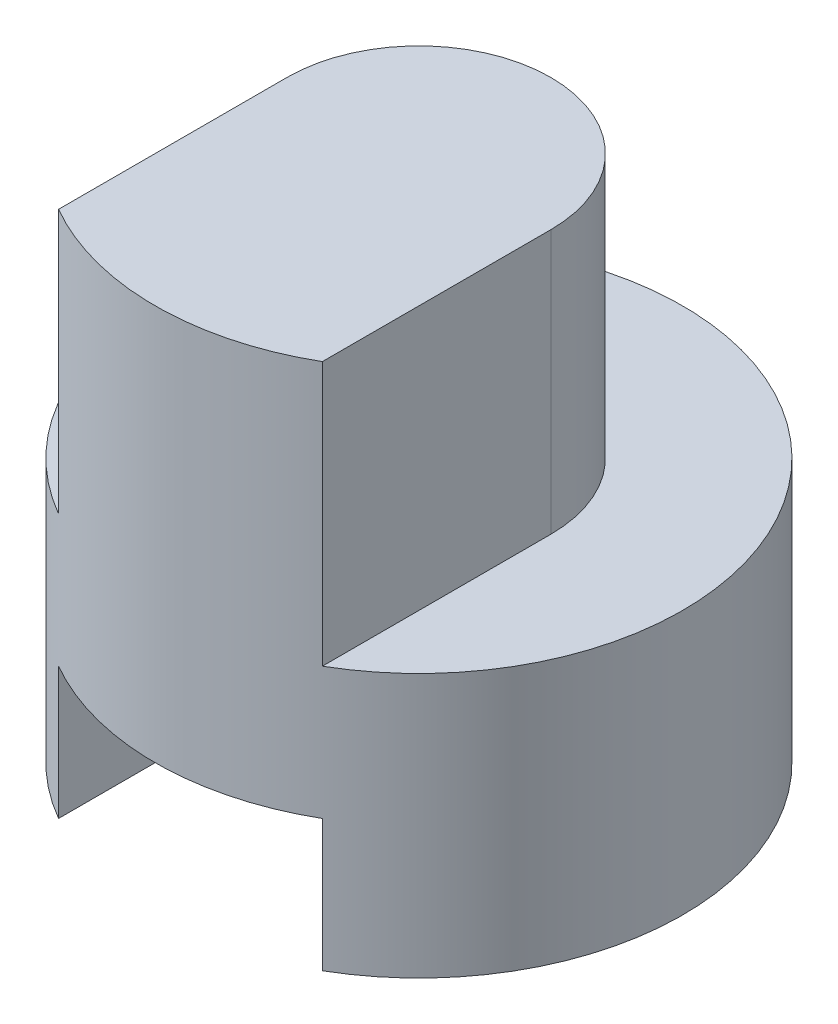
ISO-10303-21;
HEADER;
FILE_DESCRIPTION(('STEP AP214'),'2;1');
FILE_NAME('part.step','',(''),(''),'','','');
FILE_SCHEMA(('AUTOMOTIVE_DESIGN { 1 0 10303 214 1 1 1 1 }'));
ENDSEC;
DATA;
#1=APPLICATION_CONTEXT('core data for automotive mechanical design processes');
#2=APPLICATION_PROTOCOL_DEFINITION('international standard','automotive_design',2000,#1);
#3=PRODUCT_CONTEXT('',#1,'mechanical');
#4=PRODUCT('Part','Part','',(#3));
#5=PRODUCT_RELATED_PRODUCT_CATEGORY('part','',(#4));
#6=PRODUCT_DEFINITION_FORMATION('','',#4);
#7=PRODUCT_DEFINITION_CONTEXT('part definition',#1,'design');
#8=PRODUCT_DEFINITION('design','',#6,#7);
#9=PRODUCT_DEFINITION_SHAPE('','',#8);
#10=(LENGTH_UNIT() NAMED_UNIT(*) SI_UNIT(.MILLI.,.METRE.));
#11=(NAMED_UNIT(*) PLANE_ANGLE_UNIT() SI_UNIT($,.RADIAN.));
#12=(NAMED_UNIT(*) SI_UNIT($,.STERADIAN.) SOLID_ANGLE_UNIT());
#13=UNCERTAINTY_MEASURE_WITH_UNIT(LENGTH_MEASURE(1.E-05),#10,'distance_accuracy_value','');
#14=(GEOMETRIC_REPRESENTATION_CONTEXT(3) GLOBAL_UNCERTAINTY_ASSIGNED_CONTEXT((#13)) GLOBAL_UNIT_ASSIGNED_CONTEXT((#10,
#11,#12)) REPRESENTATION_CONTEXT('',''));
#15=CARTESIAN_POINT('',(0.,0.,0.));
#16=DIRECTION('',(0.,0.,1.));
#17=DIRECTION('',(1.,0.,0.));
#18=AXIS2_PLACEMENT_3D('',#15,#16,#17);
#19=CARTESIAN_POINT('',(0.,2.,0.));
#20=DIRECTION('',(0.,-1.,0.));
#21=DIRECTION('',(0.,0.,-1.));
#22=AXIS2_PLACEMENT_3D('',#19,#20,#21);
#23=CYLINDRICAL_SURFACE('',#22,2.);
#24=CARTESIAN_POINT('',(0.,2.,0.));
#25=DIRECTION('',(0.,1.,0.));
#26=DIRECTION('',(0.,0.,1.));
#27=AXIS2_PLACEMENT_3D('',#24,#25,#26);
#28=CIRCLE('',#27,2.);
#29=CARTESIAN_POINT('',(1.,2.,1.73205080756888));
#30=VERTEX_POINT('',#29);
#31=CARTESIAN_POINT('',(-1.,2.,1.73205080756888));
#32=VERTEX_POINT('',#31);
#33=EDGE_CURVE('E11',#30,#32,#28,.T.);
#34=ORIENTED_EDGE('',*,*,#33,.F.);
#35=DIRECTION('',(0.,-1.,0.));
#36=VECTOR('',#35,1.);
#37=CARTESIAN_POINT('',(1.,4.,1.73205080756888));
#38=LINE('',#37,#36);
#39=CARTESIAN_POINT('',(1.,4.,1.73205080756888));
#40=VERTEX_POINT('',#39);
#41=EDGE_CURVE('E147',#40,#30,#38,.T.);
#42=ORIENTED_EDGE('',*,*,#41,.F.);
#43=CARTESIAN_POINT('',(0.,4.,0.));
#44=DIRECTION('',(0.,1.,0.));
#45=DIRECTION('',(0.,0.,1.));
#46=AXIS2_PLACEMENT_3D('',#43,#44,#45);
#47=CIRCLE('',#46,2.);
#48=CARTESIAN_POINT('',(-1.,4.,1.73205080756888));
#49=VERTEX_POINT('',#48);
#50=EDGE_CURVE('E122',#49,#40,#47,.T.);
#51=ORIENTED_EDGE('',*,*,#50,.F.);
#52=DIRECTION('',(0.,-1.,0.));
#53=VECTOR('',#52,1.);
#54=CARTESIAN_POINT('',(-1.,4.,1.73205080756888));
#55=LINE('',#54,#53);
#56=EDGE_CURVE('E131',#49,#32,#55,.T.);
#57=ORIENTED_EDGE('',*,*,#56,.T.);
#58=EDGE_LOOP('',(#34,#42,#51,#57));
#59=FACE_BOUND('',#58,.T.);
#60=CARTESIAN_POINT('',(0.,1.,0.));
#61=DIRECTION('',(0.,-1.,0.));
#62=DIRECTION('',(0.,0.,1.));
#63=AXIS2_PLACEMENT_3D('',#60,#61,#62);
#64=CIRCLE('',#63,2.);
#65=CARTESIAN_POINT('',(1.,1.,1.73205080756888));
#66=VERTEX_POINT('',#65);
#67=CARTESIAN_POINT('',(-1.,1.,1.73205080756888));
#68=VERTEX_POINT('',#67);
#69=EDGE_CURVE('E103',#66,#68,#64,.T.);
#70=ORIENTED_EDGE('',*,*,#69,.F.);
#71=DIRECTION('',(0.,-1.,0.));
#72=VECTOR('',#71,1.);
#73=CARTESIAN_POINT('',(1.,1.,1.73205080756888));
#74=LINE('',#73,#72);
#75=CARTESIAN_POINT('',(1.,0.,1.73205080756888));
#76=VERTEX_POINT('',#75);
#77=EDGE_CURVE('E136',#66,#76,#74,.T.);
#78=ORIENTED_EDGE('',*,*,#77,.T.);
#79=CARTESIAN_POINT('',(0.,0.,0.));
#80=DIRECTION('',(0.,1.,0.));
#81=DIRECTION('',(0.,0.,1.));
#82=AXIS2_PLACEMENT_3D('',#79,#80,#81);
#83=CIRCLE('',#82,2.);
#84=CARTESIAN_POINT('',(-1.,0.,1.73205080756888));
#85=VERTEX_POINT('',#84);
#86=EDGE_CURVE('E36',#76,#85,#83,.T.);
#87=ORIENTED_EDGE('',*,*,#86,.T.);
#88=DIRECTION('',(0.,-1.,0.));
#89=VECTOR('',#88,1.);
#90=CARTESIAN_POINT('',(-1.,1.,1.73205080756888));
#91=LINE('',#90,#89);
#92=EDGE_CURVE('E47',#68,#85,#91,.T.);
#93=ORIENTED_EDGE('',*,*,#92,.F.);
#94=EDGE_LOOP('',(#70,#78,#87,#93));
#95=FACE_BOUND('',#94,.T.);
#96=ADVANCED_FACE('F33',(#59,#95),#23,.T.);
#97=CARTESIAN_POINT('',(0.,2.,0.));
#98=DIRECTION('',(0.,1.,0.));
#99=DIRECTION('',(0.,0.,1.));
#100=AXIS2_PLACEMENT_3D('',#97,#98,#99);
#101=PLANE('',#100);
#102=DIRECTION('',(0.,0.,1.));
#103=VECTOR('',#102,1.);
#104=CARTESIAN_POINT('',(-1.,2.,1.73205080756888));
#105=LINE('',#104,#103);
#106=CARTESIAN_POINT('',(-1.,2.,0.));
#107=VERTEX_POINT('',#106);
#108=EDGE_CURVE('E54',#107,#32,#105,.T.);
#109=ORIENTED_EDGE('',*,*,#108,.F.);
#110=CARTESIAN_POINT('',(0.,2.,0.));
#111=DIRECTION('',(0.,1.,0.));
#112=DIRECTION('',(0.,0.,-1.));
#113=AXIS2_PLACEMENT_3D('',#110,#111,#112);
#114=CIRCLE('',#113,1.);
#115=CARTESIAN_POINT('',(1.,2.,0.));
#116=VERTEX_POINT('',#115);
#117=EDGE_CURVE('E135',#116,#107,#114,.T.);
#118=ORIENTED_EDGE('',*,*,#117,.F.);
#119=DIRECTION('',(0.,0.,-1.));
#120=VECTOR('',#119,1.);
#121=CARTESIAN_POINT('',(1.,2.,0.));
#122=LINE('',#121,#120);
#123=EDGE_CURVE('E132',#30,#116,#122,.T.);
#124=ORIENTED_EDGE('',*,*,#123,.F.);
#125=ORIENTED_EDGE('',*,*,#33,.T.);
#126=EDGE_LOOP('',(#109,#118,#124,#125));
#127=FACE_BOUND('',#126,.T.);
#128=ADVANCED_FACE('F157',(#127),#101,.T.);
#129=CARTESIAN_POINT('',(0.,0.,0.));
#130=DIRECTION('',(0.,1.,0.));
#131=DIRECTION('',(0.,0.,1.));
#132=AXIS2_PLACEMENT_3D('',#129,#130,#131);
#133=PLANE('',#132);
#134=ORIENTED_EDGE('',*,*,#86,.F.);
#135=DIRECTION('',(0.,0.,1.));
#136=VECTOR('',#135,1.);
#137=CARTESIAN_POINT('',(1.,0.,0.));
#138=LINE('',#137,#136);
#139=CARTESIAN_POINT('',(1.,0.,0.));
#140=VERTEX_POINT('',#139);
#141=EDGE_CURVE('E112',#140,#76,#138,.T.);
#142=ORIENTED_EDGE('',*,*,#141,.F.);
#143=CARTESIAN_POINT('',(0.,0.,0.));
#144=DIRECTION('',(0.,-1.,0.));
#145=DIRECTION('',(0.,0.,-1.));
#146=AXIS2_PLACEMENT_3D('',#143,#144,#145);
#147=CIRCLE('',#146,1.);
#148=CARTESIAN_POINT('',(-1.,0.,0.));
#149=VERTEX_POINT('',#148);
#150=EDGE_CURVE('E242',#149,#140,#147,.T.);
#151=ORIENTED_EDGE('',*,*,#150,.F.);
#152=DIRECTION('',(0.,0.,-1.));
#153=VECTOR('',#152,1.);
#154=CARTESIAN_POINT('',(-1.,0.,1.73205080756888));
#155=LINE('',#154,#153);
#156=EDGE_CURVE('E244',#85,#149,#155,.T.);
#157=ORIENTED_EDGE('',*,*,#156,.F.);
#158=EDGE_LOOP('',(#134,#142,#151,#157));
#159=FACE_BOUND('',#158,.T.);
#160=ADVANCED_FACE('F184',(#159),#133,.F.);
#161=CARTESIAN_POINT('',(1.,4.,0.));
#162=DIRECTION('',(-1.,0.,0.));
#163=DIRECTION('',(0.,0.,1.));
#164=AXIS2_PLACEMENT_3D('',#161,#162,#163);
#165=PLANE('',#164);
#166=ORIENTED_EDGE('',*,*,#123,.T.);
#167=DIRECTION('',(0.,-1.,0.));
#168=VECTOR('',#167,1.);
#169=CARTESIAN_POINT('',(1.,4.,0.));
#170=LINE('',#169,#168);
#171=CARTESIAN_POINT('',(1.,4.,0.));
#172=VERTEX_POINT('',#171);
#173=EDGE_CURVE('E144',#172,#116,#170,.T.);
#174=ORIENTED_EDGE('',*,*,#173,.F.);
#175=DIRECTION('',(0.,0.,-1.));
#176=VECTOR('',#175,1.);
#177=CARTESIAN_POINT('',(1.,4.,0.));
#178=LINE('',#177,#176);
#179=EDGE_CURVE('E125',#40,#172,#178,.T.);
#180=ORIENTED_EDGE('',*,*,#179,.F.);
#181=ORIENTED_EDGE('',*,*,#41,.T.);
#182=EDGE_LOOP('',(#166,#174,#180,#181));
#183=FACE_BOUND('',#182,.T.);
#184=ADVANCED_FACE('F151',(#183),#165,.F.);
#185=CARTESIAN_POINT('',(0.,4.,0.));
#186=DIRECTION('',(0.,-1.,0.));
#187=DIRECTION('',(0.,0.,-1.));
#188=AXIS2_PLACEMENT_3D('',#185,#186,#187);
#189=CYLINDRICAL_SURFACE('',#188,1.);
#190=ORIENTED_EDGE('',*,*,#117,.T.);
#191=DIRECTION('',(0.,-1.,0.));
#192=VECTOR('',#191,1.);
#193=CARTESIAN_POINT('',(-1.,4.,0.));
#194=LINE('',#193,#192);
#195=CARTESIAN_POINT('',(-1.,4.,0.));
#196=VERTEX_POINT('',#195);
#197=EDGE_CURVE('E141',#196,#107,#194,.T.);
#198=ORIENTED_EDGE('',*,*,#197,.F.);
#199=CARTESIAN_POINT('',(0.,4.,0.));
#200=DIRECTION('',(0.,1.,0.));
#201=DIRECTION('',(0.,0.,-1.));
#202=AXIS2_PLACEMENT_3D('',#199,#200,#201);
#203=CIRCLE('',#202,1.);
#204=EDGE_CURVE('E127',#172,#196,#203,.T.);
#205=ORIENTED_EDGE('',*,*,#204,.F.);
#206=ORIENTED_EDGE('',*,*,#173,.T.);
#207=EDGE_LOOP('',(#190,#198,#205,#206));
#208=FACE_BOUND('',#207,.T.);
#209=ADVANCED_FACE('F164',(#208),#189,.T.);
#210=CARTESIAN_POINT('',(-1.,4.,1.73205080756888));
#211=DIRECTION('',(1.,0.,0.));
#212=DIRECTION('',(0.,0.,-1.));
#213=AXIS2_PLACEMENT_3D('',#210,#211,#212);
#214=PLANE('',#213);
#215=ORIENTED_EDGE('',*,*,#108,.T.);
#216=ORIENTED_EDGE('',*,*,#56,.F.);
#217=DIRECTION('',(0.,0.,1.));
#218=VECTOR('',#217,1.);
#219=CARTESIAN_POINT('',(-1.,4.,1.73205080756888));
#220=LINE('',#219,#218);
#221=EDGE_CURVE('E129',#196,#49,#220,.T.);
#222=ORIENTED_EDGE('',*,*,#221,.F.);
#223=ORIENTED_EDGE('',*,*,#197,.T.);
#224=EDGE_LOOP('',(#215,#216,#222,#223));
#225=FACE_BOUND('',#224,.T.);
#226=ADVANCED_FACE('F159',(#225),#214,.F.);
#227=CARTESIAN_POINT('',(0.,4.,0.));
#228=DIRECTION('',(0.,1.,0.));
#229=DIRECTION('',(0.,0.,1.));
#230=AXIS2_PLACEMENT_3D('',#227,#228,#229);
#231=PLANE('',#230);
#232=ORIENTED_EDGE('',*,*,#50,.T.);
#233=ORIENTED_EDGE('',*,*,#179,.T.);
#234=ORIENTED_EDGE('',*,*,#204,.T.);
#235=ORIENTED_EDGE('',*,*,#221,.T.);
#236=EDGE_LOOP('',(#232,#233,#234,#235));
#237=FACE_BOUND('',#236,.T.);
#238=ADVANCED_FACE('F166',(#237),#231,.T.);
#239=CARTESIAN_POINT('',(1.,1.,0.));
#240=DIRECTION('',(1.,0.,0.));
#241=DIRECTION('',(0.,0.,-1.));
#242=AXIS2_PLACEMENT_3D('',#239,#240,#241);
#243=PLANE('',#242);
#244=ORIENTED_EDGE('',*,*,#141,.T.);
#245=ORIENTED_EDGE('',*,*,#77,.F.);
#246=DIRECTION('',(0.,0.,1.));
#247=VECTOR('',#246,1.);
#248=CARTESIAN_POINT('',(1.,1.,0.));
#249=LINE('',#248,#247);
#250=CARTESIAN_POINT('',(1.,1.,0.));
#251=VERTEX_POINT('',#250);
#252=EDGE_CURVE('E109',#251,#66,#249,.T.);
#253=ORIENTED_EDGE('',*,*,#252,.F.);
#254=DIRECTION('',(0.,-1.,0.));
#255=VECTOR('',#254,1.);
#256=CARTESIAN_POINT('',(1.,1.,0.));
#257=LINE('',#256,#255);
#258=EDGE_CURVE('E117',#251,#140,#257,.T.);
#259=ORIENTED_EDGE('',*,*,#258,.T.);
#260=EDGE_LOOP('',(#244,#245,#253,#259));
#261=FACE_BOUND('',#260,.T.);
#262=ADVANCED_FACE('F168',(#261),#243,.F.);
#263=CARTESIAN_POINT('',(0.,1.,0.));
#264=DIRECTION('',(0.,-1.,0.));
#265=DIRECTION('',(0.,0.,-1.));
#266=AXIS2_PLACEMENT_3D('',#263,#264,#265);
#267=CYLINDRICAL_SURFACE('',#266,1.);
#268=ORIENTED_EDGE('',*,*,#150,.T.);
#269=ORIENTED_EDGE('',*,*,#258,.F.);
#270=CARTESIAN_POINT('',(0.,1.,0.));
#271=DIRECTION('',(0.,-1.,0.));
#272=DIRECTION('',(0.,0.,-1.));
#273=AXIS2_PLACEMENT_3D('',#270,#271,#272);
#274=CIRCLE('',#273,1.);
#275=CARTESIAN_POINT('',(-1.,1.,0.));
#276=VERTEX_POINT('',#275);
#277=EDGE_CURVE('E102',#276,#251,#274,.T.);
#278=ORIENTED_EDGE('',*,*,#277,.F.);
#279=DIRECTION('',(0.,-1.,0.));
#280=VECTOR('',#279,1.);
#281=CARTESIAN_POINT('',(-1.,1.,0.));
#282=LINE('',#281,#280);
#283=EDGE_CURVE('E98',#276,#149,#282,.T.);
#284=ORIENTED_EDGE('',*,*,#283,.T.);
#285=EDGE_LOOP('',(#268,#269,#278,#284));
#286=FACE_BOUND('',#285,.T.);
#287=ADVANCED_FACE('F174',(#286),#267,.F.);
#288=CARTESIAN_POINT('',(-1.,1.,1.73205080756888));
#289=DIRECTION('',(-1.,0.,0.));
#290=DIRECTION('',(0.,0.,1.));
#291=AXIS2_PLACEMENT_3D('',#288,#289,#290);
#292=PLANE('',#291);
#293=ORIENTED_EDGE('',*,*,#156,.T.);
#294=ORIENTED_EDGE('',*,*,#283,.F.);
#295=DIRECTION('',(0.,0.,-1.));
#296=VECTOR('',#295,1.);
#297=CARTESIAN_POINT('',(-1.,1.,1.73205080756888));
#298=LINE('',#297,#296);
#299=EDGE_CURVE('E95',#68,#276,#298,.T.);
#300=ORIENTED_EDGE('',*,*,#299,.F.);
#301=ORIENTED_EDGE('',*,*,#92,.T.);
#302=EDGE_LOOP('',(#293,#294,#300,#301));
#303=FACE_BOUND('',#302,.T.);
#304=ADVANCED_FACE('F97',(#303),#292,.F.);
#305=CARTESIAN_POINT('',(0.,1.,0.));
#306=DIRECTION('',(0.,1.,0.));
#307=DIRECTION('',(0.,0.,1.));
#308=AXIS2_PLACEMENT_3D('',#305,#306,#307);
#309=PLANE('',#308);
#310=ORIENTED_EDGE('',*,*,#69,.T.);
#311=ORIENTED_EDGE('',*,*,#299,.T.);
#312=ORIENTED_EDGE('',*,*,#277,.T.);
#313=ORIENTED_EDGE('',*,*,#252,.T.);
#314=EDGE_LOOP('',(#310,#311,#312,#313));
#315=FACE_BOUND('',#314,.T.);
#316=ADVANCED_FACE('F107',(#315),#309,.F.);
#317=CLOSED_SHELL('',(#96,#128,#160,#184,#209,#226,#238,#262,#287,#304,#316));
#318=MANIFOLD_SOLID_BREP('B2',#317);
#319=ADVANCED_BREP_SHAPE_REPRESENTATION('',(#18,#318),#14);
#320=SHAPE_DEFINITION_REPRESENTATION(#9,#319);
ENDSEC;
END-ISO-10303-21;
